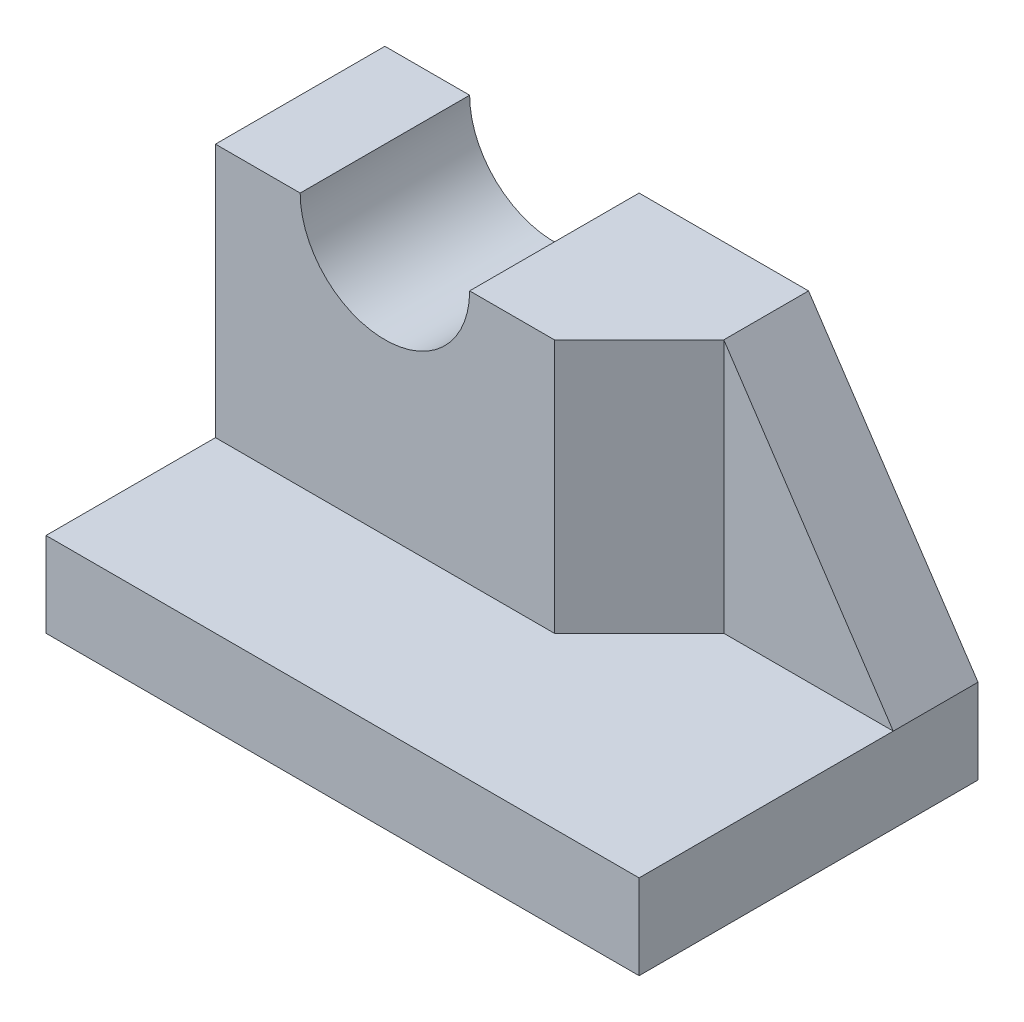
ISO-10303-21;
HEADER;
FILE_DESCRIPTION(('STEP AP214'),'2;1');
FILE_NAME('part.step','',(''),(''),'','','');
FILE_SCHEMA(('AUTOMOTIVE_DESIGN { 1 0 10303 214 1 1 1 1 }'));
ENDSEC;
DATA;
#1=APPLICATION_CONTEXT('core data for automotive mechanical design processes');
#2=APPLICATION_PROTOCOL_DEFINITION('international standard','automotive_design',2000,#1);
#3=PRODUCT_CONTEXT('',#1,'mechanical');
#4=PRODUCT('Part','Part','',(#3));
#5=PRODUCT_RELATED_PRODUCT_CATEGORY('part','',(#4));
#6=PRODUCT_DEFINITION_FORMATION('','',#4);
#7=PRODUCT_DEFINITION_CONTEXT('part definition',#1,'design');
#8=PRODUCT_DEFINITION('design','',#6,#7);
#9=PRODUCT_DEFINITION_SHAPE('','',#8);
#10=(LENGTH_UNIT() NAMED_UNIT(*) SI_UNIT(.MILLI.,.METRE.));
#11=(NAMED_UNIT(*) PLANE_ANGLE_UNIT() SI_UNIT($,.RADIAN.));
#12=(NAMED_UNIT(*) SI_UNIT($,.STERADIAN.) SOLID_ANGLE_UNIT());
#13=UNCERTAINTY_MEASURE_WITH_UNIT(LENGTH_MEASURE(1.E-05),#10,'distance_accuracy_value','');
#14=(GEOMETRIC_REPRESENTATION_CONTEXT(3) GLOBAL_UNCERTAINTY_ASSIGNED_CONTEXT((#13)) GLOBAL_UNIT_ASSIGNED_CONTEXT((#10,
#11,#12)) REPRESENTATION_CONTEXT('',''));
#15=CARTESIAN_POINT('',(0.,0.,0.));
#16=DIRECTION('',(0.,0.,1.));
#17=DIRECTION('',(1.,0.,0.));
#18=AXIS2_PLACEMENT_3D('',#15,#16,#17);
#19=CARTESIAN_POINT('',(0.,20.,0.));
#20=DIRECTION('',(0.,1.,0.));
#21=DIRECTION('',(0.,0.,1.));
#22=AXIS2_PLACEMENT_3D('',#19,#20,#21);
#23=PLANE('',#22);
#24=DIRECTION('',(0.,0.,1.));
#25=VECTOR('',#24,1.);
#26=CARTESIAN_POINT('',(-12.5,20.,-20.));
#27=LINE('',#26,#25);
#28=CARTESIAN_POINT('',(-12.5,20.,-10.));
#29=VERTEX_POINT('',#28);
#30=CARTESIAN_POINT('',(-12.5,20.,0.));
#31=VERTEX_POINT('',#30);
#32=EDGE_CURVE('E47',#29,#31,#27,.T.);
#33=ORIENTED_EDGE('',*,*,#32,.F.);
#34=DIRECTION('',(1.,0.,0.));
#35=VECTOR('',#34,1.);
#36=CARTESIAN_POINT('',(0.,20.,-10.));
#37=LINE('',#36,#35);
#38=CARTESIAN_POINT('',(-17.5,20.,-10.));
#39=VERTEX_POINT('',#38);
#40=EDGE_CURVE('E141',#39,#29,#37,.T.);
#41=ORIENTED_EDGE('',*,*,#40,.F.);
#42=DIRECTION('',(0.,0.,-1.));
#43=VECTOR('',#42,1.);
#44=CARTESIAN_POINT('',(-17.5,20.,0.));
#45=LINE('',#44,#43);
#46=CARTESIAN_POINT('',(-17.5,20.,0.));
#47=VERTEX_POINT('',#46);
#48=EDGE_CURVE('E132',#47,#39,#45,.T.);
#49=ORIENTED_EDGE('',*,*,#48,.F.);
#50=DIRECTION('',(1.,0.,0.));
#51=VECTOR('',#50,1.);
#52=CARTESIAN_POINT('',(0.,20.,0.));
#53=LINE('',#52,#51);
#54=EDGE_CURVE('E125',#47,#31,#53,.T.);
#55=ORIENTED_EDGE('',*,*,#54,.T.);
#56=EDGE_LOOP('',(#33,#41,#49,#55));
#57=FACE_BOUND('',#56,.T.);
#58=ADVANCED_FACE('F39',(#57),#23,.T.);
#59=CARTESIAN_POINT('',(0.,5.,0.));
#60=DIRECTION('',(0.,1.,0.));
#61=DIRECTION('',(0.,0.,1.));
#62=AXIS2_PLACEMENT_3D('',#59,#60,#61);
#63=PLANE('',#62);
#64=DIRECTION('',(-0.707106781186548,0.,0.707106781186548));
#65=VECTOR('',#64,1.);
#66=CARTESIAN_POINT('',(1.25,5.,1.25));
#67=LINE('',#66,#65);
#68=CARTESIAN_POINT('',(7.5,5.,-5.));
#69=VERTEX_POINT('',#68);
#70=CARTESIAN_POINT('',(2.5,5.,0.));
#71=VERTEX_POINT('',#70);
#72=EDGE_CURVE('E155',#69,#71,#67,.T.);
#73=ORIENTED_EDGE('',*,*,#72,.T.);
#74=DIRECTION('',(-1.,0.,0.));
#75=VECTOR('',#74,1.);
#76=CARTESIAN_POINT('',(0.,5.,0.));
#77=LINE('',#76,#75);
#78=CARTESIAN_POINT('',(-17.5,5.,0.));
#79=VERTEX_POINT('',#78);
#80=EDGE_CURVE('E158',#71,#79,#77,.T.);
#81=ORIENTED_EDGE('',*,*,#80,.T.);
#82=DIRECTION('',(0.,0.,-1.));
#83=VECTOR('',#82,1.);
#84=CARTESIAN_POINT('',(-17.5,5.,0.));
#85=LINE('',#84,#83);
#86=CARTESIAN_POINT('',(-17.5,5.,10.));
#87=VERTEX_POINT('',#86);
#88=EDGE_CURVE('E164',#87,#79,#85,.T.);
#89=ORIENTED_EDGE('',*,*,#88,.F.);
#90=DIRECTION('',(1.,0.,0.));
#91=VECTOR('',#90,1.);
#92=CARTESIAN_POINT('',(0.,5.,10.));
#93=LINE('',#92,#91);
#94=CARTESIAN_POINT('',(17.5,5.,10.));
#95=VERTEX_POINT('',#94);
#96=EDGE_CURVE('E168',#87,#95,#93,.T.);
#97=ORIENTED_EDGE('',*,*,#96,.T.);
#98=DIRECTION('',(0.,0.,-1.));
#99=VECTOR('',#98,1.);
#100=CARTESIAN_POINT('',(17.5,5.,0.));
#101=LINE('',#100,#99);
#102=CARTESIAN_POINT('',(17.5,5.,-5.));
#103=VERTEX_POINT('',#102);
#104=EDGE_CURVE('E162',#95,#103,#101,.T.);
#105=ORIENTED_EDGE('',*,*,#104,.T.);
#106=DIRECTION('',(-1.,0.,0.));
#107=VECTOR('',#106,1.);
#108=CARTESIAN_POINT('',(0.,5.,-5.));
#109=LINE('',#108,#107);
#110=EDGE_CURVE('E152',#103,#69,#109,.T.);
#111=ORIENTED_EDGE('',*,*,#110,.T.);
#112=EDGE_LOOP('',(#73,#81,#89,#97,#105,#111));
#113=FACE_BOUND('',#112,.T.);
#114=ADVANCED_FACE('F220',(#113),#63,.T.);
#115=CARTESIAN_POINT('',(17.5,5.,0.));
#116=DIRECTION('',(-1.,0.,0.));
#117=DIRECTION('',(0.,0.,1.));
#118=AXIS2_PLACEMENT_3D('',#115,#116,#117);
#119=PLANE('',#118);
#120=DIRECTION('',(0.,-1.,0.));
#121=VECTOR('',#120,1.);
#122=CARTESIAN_POINT('',(17.5,5.,-10.));
#123=LINE('',#122,#121);
#124=CARTESIAN_POINT('',(17.5,5.,-10.));
#125=VERTEX_POINT('',#124);
#126=CARTESIAN_POINT('',(17.5,0.,-10.));
#127=VERTEX_POINT('',#126);
#128=EDGE_CURVE('E186',#125,#127,#123,.T.);
#129=ORIENTED_EDGE('',*,*,#128,.F.);
#130=DIRECTION('',(0.,0.,1.));
#131=VECTOR('',#130,1.);
#132=CARTESIAN_POINT('',(17.5,5.,-20.));
#133=LINE('',#132,#131);
#134=EDGE_CURVE('E129',#125,#103,#133,.T.);
#135=ORIENTED_EDGE('',*,*,#134,.T.);
#136=ORIENTED_EDGE('',*,*,#104,.F.);
#137=DIRECTION('',(0.,-1.,0.));
#138=VECTOR('',#137,1.);
#139=CARTESIAN_POINT('',(17.5,5.,10.));
#140=LINE('',#139,#138);
#141=CARTESIAN_POINT('',(17.5,0.,10.));
#142=VERTEX_POINT('',#141);
#143=EDGE_CURVE('E170',#95,#142,#140,.T.);
#144=ORIENTED_EDGE('',*,*,#143,.T.);
#145=DIRECTION('',(0.,0.,-1.));
#146=VECTOR('',#145,1.);
#147=CARTESIAN_POINT('',(17.5,0.,0.));
#148=LINE('',#147,#146);
#149=EDGE_CURVE('E161',#142,#127,#148,.T.);
#150=ORIENTED_EDGE('',*,*,#149,.T.);
#151=EDGE_LOOP('',(#129,#135,#136,#144,#150));
#152=FACE_BOUND('',#151,.T.);
#153=ADVANCED_FACE('F41',(#152),#119,.F.);
#154=CARTESIAN_POINT('',(0.,5.,-10.));
#155=DIRECTION('',(0.,0.,-1.));
#156=DIRECTION('',(-1.,0.,0.));
#157=AXIS2_PLACEMENT_3D('',#154,#155,#156);
#158=PLANE('',#157);
#159=DIRECTION('',(-0.554700196225229,0.832050294337844,0.));
#160=VECTOR('',#159,1.);
#161=CARTESIAN_POINT('',(12.1153846153846,13.0769230769231,-10.));
#162=LINE('',#161,#160);
#163=CARTESIAN_POINT('',(7.5,20.,-10.));
#164=VERTEX_POINT('',#163);
#165=EDGE_CURVE('E53',#125,#164,#162,.T.);
#166=ORIENTED_EDGE('',*,*,#165,.F.);
#167=ORIENTED_EDGE('',*,*,#128,.T.);
#168=DIRECTION('',(1.,0.,0.));
#169=VECTOR('',#168,1.);
#170=CARTESIAN_POINT('',(0.,0.,-10.));
#171=LINE('',#170,#169);
#172=CARTESIAN_POINT('',(-17.5,0.,-10.));
#173=VERTEX_POINT('',#172);
#174=EDGE_CURVE('E173',#173,#127,#171,.T.);
#175=ORIENTED_EDGE('',*,*,#174,.F.);
#176=DIRECTION('',(0.,-1.,0.));
#177=VECTOR('',#176,1.);
#178=CARTESIAN_POINT('',(-17.5,5.,-10.));
#179=LINE('',#178,#177);
#180=EDGE_CURVE('E183',#39,#173,#179,.T.);
#181=ORIENTED_EDGE('',*,*,#180,.F.);
#182=ORIENTED_EDGE('',*,*,#40,.T.);
#183=CARTESIAN_POINT('',(-7.5,20.,-10.));
#184=DIRECTION('',(0.,0.,-1.));
#185=DIRECTION('',(-1.,0.,0.));
#186=AXIS2_PLACEMENT_3D('',#183,#184,#185);
#187=CIRCLE('',#186,5.);
#188=CARTESIAN_POINT('',(-2.5,20.,-10.));
#189=VERTEX_POINT('',#188);
#190=EDGE_CURVE('E115',#189,#29,#187,.T.);
#191=ORIENTED_EDGE('',*,*,#190,.F.);
#192=EDGE_CURVE('E136',#189,#164,#37,.T.);
#193=ORIENTED_EDGE('',*,*,#192,.T.);
#194=EDGE_LOOP('',(#166,#167,#175,#181,#182,#191,#193));
#195=FACE_BOUND('',#194,.T.);
#196=ADVANCED_FACE('F192',(#195),#158,.T.);
#197=CARTESIAN_POINT('',(-17.5,5.,0.));
#198=DIRECTION('',(-1.,0.,0.));
#199=DIRECTION('',(0.,0.,1.));
#200=AXIS2_PLACEMENT_3D('',#197,#198,#199);
#201=PLANE('',#200);
#202=ORIENTED_EDGE('',*,*,#180,.T.);
#203=DIRECTION('',(0.,0.,-1.));
#204=VECTOR('',#203,1.);
#205=CARTESIAN_POINT('',(-17.5,0.,0.));
#206=LINE('',#205,#204);
#207=CARTESIAN_POINT('',(-17.5,0.,10.));
#208=VERTEX_POINT('',#207);
#209=EDGE_CURVE('E176',#208,#173,#206,.T.);
#210=ORIENTED_EDGE('',*,*,#209,.F.);
#211=DIRECTION('',(0.,-1.,0.));
#212=VECTOR('',#211,1.);
#213=CARTESIAN_POINT('',(-17.5,5.,10.));
#214=LINE('',#213,#212);
#215=EDGE_CURVE('E181',#87,#208,#214,.T.);
#216=ORIENTED_EDGE('',*,*,#215,.F.);
#217=ORIENTED_EDGE('',*,*,#88,.T.);
#218=DIRECTION('',(0.,-1.,0.));
#219=VECTOR('',#218,1.);
#220=CARTESIAN_POINT('',(-17.5,20.,0.));
#221=LINE('',#220,#219);
#222=EDGE_CURVE('E144',#47,#79,#221,.T.);
#223=ORIENTED_EDGE('',*,*,#222,.F.);
#224=ORIENTED_EDGE('',*,*,#48,.T.);
#225=EDGE_LOOP('',(#202,#210,#216,#217,#223,#224));
#226=FACE_BOUND('',#225,.T.);
#227=ADVANCED_FACE('F217',(#226),#201,.T.);
#228=CARTESIAN_POINT('',(0.,5.,10.));
#229=DIRECTION('',(0.,0.,-1.));
#230=DIRECTION('',(-1.,0.,0.));
#231=AXIS2_PLACEMENT_3D('',#228,#229,#230);
#232=PLANE('',#231);
#233=DIRECTION('',(1.,0.,0.));
#234=VECTOR('',#233,1.);
#235=CARTESIAN_POINT('',(0.,0.,10.));
#236=LINE('',#235,#234);
#237=EDGE_CURVE('E165',#208,#142,#236,.T.);
#238=ORIENTED_EDGE('',*,*,#237,.T.);
#239=ORIENTED_EDGE('',*,*,#143,.F.);
#240=ORIENTED_EDGE('',*,*,#96,.F.);
#241=ORIENTED_EDGE('',*,*,#215,.T.);
#242=EDGE_LOOP('',(#238,#239,#240,#241));
#243=FACE_BOUND('',#242,.T.);
#244=ADVANCED_FACE('F316',(#243),#232,.F.);
#245=CARTESIAN_POINT('',(0.,0.,0.));
#246=DIRECTION('',(0.,1.,0.));
#247=DIRECTION('',(0.,0.,1.));
#248=AXIS2_PLACEMENT_3D('',#245,#246,#247);
#249=PLANE('',#248);
#250=ORIENTED_EDGE('',*,*,#209,.T.);
#251=ORIENTED_EDGE('',*,*,#174,.T.);
#252=ORIENTED_EDGE('',*,*,#149,.F.);
#253=ORIENTED_EDGE('',*,*,#237,.F.);
#254=EDGE_LOOP('',(#250,#251,#252,#253));
#255=FACE_BOUND('',#254,.T.);
#256=ADVANCED_FACE('F214',(#255),#249,.F.);
#257=CARTESIAN_POINT('',(0.,20.,0.));
#258=DIRECTION('',(0.,0.,-1.));
#259=DIRECTION('',(-1.,0.,0.));
#260=AXIS2_PLACEMENT_3D('',#257,#258,#259);
#261=PLANE('',#260);
#262=CARTESIAN_POINT('',(-2.5,20.,0.));
#263=VERTEX_POINT('',#262);
#264=CARTESIAN_POINT('',(2.5,20.,0.));
#265=VERTEX_POINT('',#264);
#266=EDGE_CURVE('E128',#263,#265,#53,.T.);
#267=ORIENTED_EDGE('',*,*,#266,.F.);
#268=CARTESIAN_POINT('',(-7.5,20.,0.));
#269=DIRECTION('',(0.,0.,1.));
#270=DIRECTION('',(1.,0.,0.));
#271=AXIS2_PLACEMENT_3D('',#268,#269,#270);
#272=CIRCLE('',#271,5.);
#273=EDGE_CURVE('E61',#31,#263,#272,.T.);
#274=ORIENTED_EDGE('',*,*,#273,.F.);
#275=ORIENTED_EDGE('',*,*,#54,.F.);
#276=ORIENTED_EDGE('',*,*,#222,.T.);
#277=ORIENTED_EDGE('',*,*,#80,.F.);
#278=DIRECTION('',(0.,-1.,0.));
#279=VECTOR('',#278,1.);
#280=CARTESIAN_POINT('',(2.5,20.,0.));
#281=LINE('',#280,#279);
#282=EDGE_CURVE('E149',#265,#71,#281,.T.);
#283=ORIENTED_EDGE('',*,*,#282,.F.);
#284=EDGE_LOOP('',(#267,#274,#275,#276,#277,#283));
#285=FACE_BOUND('',#284,.T.);
#286=ADVANCED_FACE('F124',(#285),#261,.F.);
#287=CARTESIAN_POINT('',(1.25,20.,1.25));
#288=DIRECTION('',(-0.707106781186548,0.,-0.707106781186548));
#289=DIRECTION('',(-0.707106781186548,0.,0.707106781186548));
#290=AXIS2_PLACEMENT_3D('',#287,#288,#289);
#291=PLANE('',#290);
#292=ORIENTED_EDGE('',*,*,#72,.F.);
#293=DIRECTION('',(0.,-1.,0.));
#294=VECTOR('',#293,1.);
#295=CARTESIAN_POINT('',(7.5,20.,-5.));
#296=LINE('',#295,#294);
#297=CARTESIAN_POINT('',(7.5,20.,-5.));
#298=VERTEX_POINT('',#297);
#299=EDGE_CURVE('E146',#298,#69,#296,.T.);
#300=ORIENTED_EDGE('',*,*,#299,.F.);
#301=DIRECTION('',(0.707106781186548,0.,-0.707106781186548));
#302=VECTOR('',#301,1.);
#303=CARTESIAN_POINT('',(1.25,20.,1.25));
#304=LINE('',#303,#302);
#305=EDGE_CURVE('E133',#265,#298,#304,.T.);
#306=ORIENTED_EDGE('',*,*,#305,.F.);
#307=ORIENTED_EDGE('',*,*,#282,.T.);
#308=EDGE_LOOP('',(#292,#300,#306,#307));
#309=FACE_BOUND('',#308,.T.);
#310=ADVANCED_FACE('F222',(#309),#291,.F.);
#311=CARTESIAN_POINT('',(0.,20.,-5.));
#312=DIRECTION('',(0.,0.,-1.));
#313=DIRECTION('',(-1.,0.,0.));
#314=AXIS2_PLACEMENT_3D('',#311,#312,#313);
#315=PLANE('',#314);
#316=ORIENTED_EDGE('',*,*,#110,.F.);
#317=DIRECTION('',(-0.554700196225229,0.832050294337844,0.));
#318=VECTOR('',#317,1.);
#319=CARTESIAN_POINT('',(5.19230769230769,23.4615384615385,-5.));
#320=LINE('',#319,#318);
#321=EDGE_CURVE('E193',#103,#298,#320,.T.);
#322=ORIENTED_EDGE('',*,*,#321,.T.);
#323=ORIENTED_EDGE('',*,*,#299,.T.);
#324=EDGE_LOOP('',(#316,#322,#323));
#325=FACE_BOUND('',#324,.T.);
#326=ADVANCED_FACE('F204',(#325),#315,.F.);
#327=DIRECTION('',(0.,0.,1.));
#328=VECTOR('',#327,1.);
#329=CARTESIAN_POINT('',(7.5,20.,0.));
#330=LINE('',#329,#328);
#331=EDGE_CURVE('E11',#164,#298,#330,.T.);
#332=ORIENTED_EDGE('',*,*,#331,.F.);
#333=ORIENTED_EDGE('',*,*,#192,.F.);
#334=DIRECTION('',(0.,0.,1.));
#335=VECTOR('',#334,1.);
#336=CARTESIAN_POINT('',(-2.5,20.,-20.));
#337=LINE('',#336,#335);
#338=EDGE_CURVE('E120',#263,#189,#337,.F.);
#339=ORIENTED_EDGE('',*,*,#338,.F.);
#340=ORIENTED_EDGE('',*,*,#266,.T.);
#341=ORIENTED_EDGE('',*,*,#305,.T.);
#342=EDGE_LOOP('',(#332,#333,#339,#340,#341));
#343=FACE_BOUND('',#342,.T.);
#344=ADVANCED_FACE('F195',(#343),#23,.T.);
#345=CARTESIAN_POINT('',(-7.5,20.,-20.));
#346=DIRECTION('',(0.,0.,1.));
#347=DIRECTION('',(1.,0.,0.));
#348=AXIS2_PLACEMENT_3D('',#345,#346,#347);
#349=CYLINDRICAL_SURFACE('',#348,5.);
#350=ORIENTED_EDGE('',*,*,#190,.T.);
#351=ORIENTED_EDGE('',*,*,#32,.T.);
#352=ORIENTED_EDGE('',*,*,#273,.T.);
#353=ORIENTED_EDGE('',*,*,#338,.T.);
#354=EDGE_LOOP('',(#350,#351,#352,#353));
#355=FACE_BOUND('',#354,.T.);
#356=ADVANCED_FACE('F113',(#355),#349,.F.);
#357=CARTESIAN_POINT('',(17.5,5.,-20.));
#358=DIRECTION('',(-0.832050294337844,-0.554700196225229,0.));
#359=DIRECTION('',(0.554700196225229,-0.832050294337844,0.));
#360=AXIS2_PLACEMENT_3D('',#357,#358,#359);
#361=PLANE('',#360);
#362=ORIENTED_EDGE('',*,*,#165,.T.);
#363=ORIENTED_EDGE('',*,*,#331,.T.);
#364=ORIENTED_EDGE('',*,*,#321,.F.);
#365=ORIENTED_EDGE('',*,*,#134,.F.);
#366=EDGE_LOOP('',(#362,#363,#364,#365));
#367=FACE_BOUND('',#366,.T.);
#368=ADVANCED_FACE('F200',(#367),#361,.F.);
#369=CLOSED_SHELL('',(#58,#114,#153,#196,#227,#244,#256,#286,#310,#326,#344,#356,#368));
#370=MANIFOLD_SOLID_BREP('B2',#369);
#371=ADVANCED_BREP_SHAPE_REPRESENTATION('',(#18,#370),#14);
#372=SHAPE_DEFINITION_REPRESENTATION(#9,#371);
ENDSEC;
END-ISO-10303-21;
